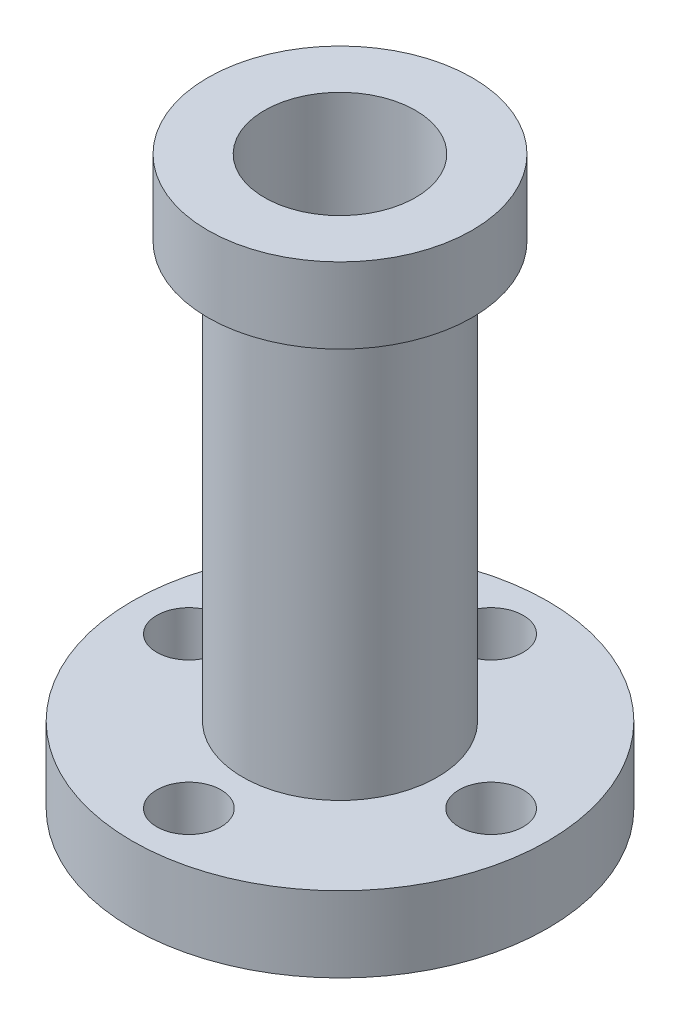
ISO-10303-21;
HEADER;
FILE_DESCRIPTION(('STEP AP214'),'2;1');
FILE_NAME('part.step','',(''),(''),'','','');
FILE_SCHEMA(('AUTOMOTIVE_DESIGN { 1 0 10303 214 1 1 1 1 }'));
ENDSEC;
DATA;
#1=APPLICATION_CONTEXT('core data for automotive mechanical design processes');
#2=APPLICATION_PROTOCOL_DEFINITION('international standard','automotive_design',2000,#1);
#3=PRODUCT_CONTEXT('',#1,'mechanical');
#4=PRODUCT('Part','Part','',(#3));
#5=PRODUCT_RELATED_PRODUCT_CATEGORY('part','',(#4));
#6=PRODUCT_DEFINITION_FORMATION('','',#4);
#7=PRODUCT_DEFINITION_CONTEXT('part definition',#1,'design');
#8=PRODUCT_DEFINITION('design','',#6,#7);
#9=PRODUCT_DEFINITION_SHAPE('','',#8);
#10=(LENGTH_UNIT() NAMED_UNIT(*) SI_UNIT(.MILLI.,.METRE.));
#11=(NAMED_UNIT(*) PLANE_ANGLE_UNIT() SI_UNIT($,.RADIAN.));
#12=(NAMED_UNIT(*) SI_UNIT($,.STERADIAN.) SOLID_ANGLE_UNIT());
#13=UNCERTAINTY_MEASURE_WITH_UNIT(LENGTH_MEASURE(1.E-05),#10,'distance_accuracy_value','');
#14=(GEOMETRIC_REPRESENTATION_CONTEXT(3) GLOBAL_UNCERTAINTY_ASSIGNED_CONTEXT((#13)) GLOBAL_UNIT_ASSIGNED_CONTEXT((#10,
#11,#12)) REPRESENTATION_CONTEXT('',''));
#15=CARTESIAN_POINT('',(0.,0.,0.));
#16=DIRECTION('',(0.,0.,1.));
#17=DIRECTION('',(1.,0.,0.));
#18=AXIS2_PLACEMENT_3D('',#15,#16,#17);
#19=CARTESIAN_POINT('',(11.,4.,0.));
#20=DIRECTION('',(0.,1.,0.));
#21=DIRECTION('',(0.,0.,1.));
#22=AXIS2_PLACEMENT_3D('',#19,#20,#21);
#23=PLANE('',#22);
#24=CARTESIAN_POINT('',(8.,4.,0.));
#25=DIRECTION('',(0.,1.,0.));
#26=DIRECTION('',(0.,0.,1.));
#27=AXIS2_PLACEMENT_3D('',#24,#25,#26);
#28=CIRCLE('',#27,1.69999999999999);
#29=CARTESIAN_POINT('',(8.,4.,1.69999999999999));
#30=VERTEX_POINT('',#29);
#31=EDGE_CURVE('E93',#30,#30,#28,.F.);
#32=ORIENTED_EDGE('',*,*,#31,.T.);
#33=EDGE_LOOP('',(#32));
#34=FACE_BOUND('',#33,.T.);
#35=CARTESIAN_POINT('',(-8.,4.,0.));
#36=DIRECTION('',(0.,1.,0.));
#37=DIRECTION('',(0.,0.,1.));
#38=AXIS2_PLACEMENT_3D('',#35,#36,#37);
#39=CIRCLE('',#38,1.69999999999999);
#40=CARTESIAN_POINT('',(-8.,4.,1.69999999999999));
#41=VERTEX_POINT('',#40);
#42=EDGE_CURVE('E77',#41,#41,#39,.F.);
#43=ORIENTED_EDGE('',*,*,#42,.T.);
#44=EDGE_LOOP('',(#43));
#45=FACE_BOUND('',#44,.T.);
#46=CARTESIAN_POINT('',(0.,4.,0.));
#47=DIRECTION('',(0.,-1.,0.));
#48=DIRECTION('',(0.,0.,-1.));
#49=AXIS2_PLACEMENT_3D('',#46,#47,#48);
#50=CIRCLE('',#49,5.15);
#51=CARTESIAN_POINT('',(0.,4.,-5.15));
#52=VERTEX_POINT('',#51);
#53=EDGE_CURVE('E61',#52,#52,#50,.T.);
#54=ORIENTED_EDGE('',*,*,#53,.T.);
#55=EDGE_LOOP('',(#54));
#56=FACE_BOUND('',#55,.T.);
#57=CARTESIAN_POINT('',(0.,4.,0.));
#58=DIRECTION('',(0.,-1.,0.));
#59=DIRECTION('',(0.,0.,-1.));
#60=AXIS2_PLACEMENT_3D('',#57,#58,#59);
#61=CIRCLE('',#60,11.);
#62=CARTESIAN_POINT('',(0.,4.,-11.));
#63=VERTEX_POINT('',#62);
#64=EDGE_CURVE('E55',#63,#63,#61,.T.);
#65=ORIENTED_EDGE('',*,*,#64,.F.);
#66=EDGE_LOOP('',(#65));
#67=FACE_BOUND('',#66,.T.);
#68=CARTESIAN_POINT('',(0.,4.,-8.));
#69=DIRECTION('',(0.,1.,0.));
#70=DIRECTION('',(0.,0.,1.));
#71=AXIS2_PLACEMENT_3D('',#68,#69,#70);
#72=CIRCLE('',#71,1.69999999999999);
#73=CARTESIAN_POINT('',(0.,4.,-6.30000000000001));
#74=VERTEX_POINT('',#73);
#75=EDGE_CURVE('E85',#74,#74,#72,.F.);
#76=ORIENTED_EDGE('',*,*,#75,.T.);
#77=EDGE_LOOP('',(#76));
#78=FACE_BOUND('',#77,.T.);
#79=CARTESIAN_POINT('',(0.,4.,8.));
#80=DIRECTION('',(0.,1.,0.));
#81=DIRECTION('',(0.,0.,1.));
#82=AXIS2_PLACEMENT_3D('',#79,#80,#81);
#83=CIRCLE('',#82,1.69999999999999);
#84=CARTESIAN_POINT('',(0.,4.,9.69999999999999));
#85=VERTEX_POINT('',#84);
#86=EDGE_CURVE('E101',#85,#85,#83,.F.);
#87=ORIENTED_EDGE('',*,*,#86,.T.);
#88=EDGE_LOOP('',(#87));
#89=FACE_BOUND('',#88,.T.);
#90=ADVANCED_FACE('F37',(#34,#45,#56,#67,#78,#89),#23,.T.);
#91=CARTESIAN_POINT('',(7.,30.,0.));
#92=DIRECTION('',(0.,1.,0.));
#93=DIRECTION('',(0.,0.,1.));
#94=AXIS2_PLACEMENT_3D('',#91,#92,#93);
#95=PLANE('',#94);
#96=CARTESIAN_POINT('',(0.,30.,0.));
#97=DIRECTION('',(0.,-1.,0.));
#98=DIRECTION('',(0.,0.,-1.));
#99=AXIS2_PLACEMENT_3D('',#96,#97,#98);
#100=CIRCLE('',#99,4.);
#101=CARTESIAN_POINT('',(0.,30.,-4.));
#102=VERTEX_POINT('',#101);
#103=EDGE_CURVE('E10',#102,#102,#100,.T.);
#104=ORIENTED_EDGE('',*,*,#103,.T.);
#105=EDGE_LOOP('',(#104));
#106=FACE_BOUND('',#105,.T.);
#107=CARTESIAN_POINT('',(0.,30.,0.));
#108=DIRECTION('',(0.,-1.,0.));
#109=DIRECTION('',(0.,0.,-1.));
#110=AXIS2_PLACEMENT_3D('',#107,#108,#109);
#111=CIRCLE('',#110,7.);
#112=CARTESIAN_POINT('',(0.,30.,-7.));
#113=VERTEX_POINT('',#112);
#114=EDGE_CURVE('E73',#113,#113,#111,.T.);
#115=ORIENTED_EDGE('',*,*,#114,.F.);
#116=EDGE_LOOP('',(#115));
#117=FACE_BOUND('',#116,.T.);
#118=ADVANCED_FACE('F39',(#106,#117),#95,.T.);
#119=CARTESIAN_POINT('',(0.,0.,0.));
#120=DIRECTION('',(0.,-1.,0.));
#121=DIRECTION('',(0.,0.,-1.));
#122=AXIS2_PLACEMENT_3D('',#119,#120,#121);
#123=CYLINDRICAL_SURFACE('',#122,4.);
#124=CARTESIAN_POINT('',(0.,0.,0.));
#125=DIRECTION('',(0.,-1.,0.));
#126=DIRECTION('',(0.,0.,-1.));
#127=AXIS2_PLACEMENT_3D('',#124,#125,#126);
#128=CIRCLE('',#127,4.);
#129=CARTESIAN_POINT('',(0.,0.,-4.));
#130=VERTEX_POINT('',#129);
#131=EDGE_CURVE('E45',#130,#130,#128,.T.);
#132=ORIENTED_EDGE('',*,*,#131,.T.);
#133=EDGE_LOOP('',(#132));
#134=FACE_BOUND('',#133,.T.);
#135=ORIENTED_EDGE('',*,*,#103,.F.);
#136=EDGE_LOOP('',(#135));
#137=FACE_BOUND('',#136,.T.);
#138=ADVANCED_FACE('F116',(#134,#137),#123,.F.);
#139=CARTESIAN_POINT('',(4.,0.,0.));
#140=DIRECTION('',(0.,-1.,0.));
#141=DIRECTION('',(0.,0.,-1.));
#142=AXIS2_PLACEMENT_3D('',#139,#140,#141);
#143=PLANE('',#142);
#144=CARTESIAN_POINT('',(0.,0.,8.));
#145=DIRECTION('',(0.,-1.,0.));
#146=DIRECTION('',(0.,0.,-1.));
#147=AXIS2_PLACEMENT_3D('',#144,#145,#146);
#148=CIRCLE('',#147,1.69999999999999);
#149=CARTESIAN_POINT('',(0.,0.,6.30000000000001));
#150=VERTEX_POINT('',#149);
#151=EDGE_CURVE('E105',#150,#150,#148,.T.);
#152=ORIENTED_EDGE('',*,*,#151,.F.);
#153=EDGE_LOOP('',(#152));
#154=FACE_BOUND('',#153,.T.);
#155=CARTESIAN_POINT('',(8.,0.,0.));
#156=DIRECTION('',(0.,-1.,0.));
#157=DIRECTION('',(0.,0.,-1.));
#158=AXIS2_PLACEMENT_3D('',#155,#156,#157);
#159=CIRCLE('',#158,1.69999999999999);
#160=CARTESIAN_POINT('',(8.,0.,-1.69999999999999));
#161=VERTEX_POINT('',#160);
#162=EDGE_CURVE('E97',#161,#161,#159,.T.);
#163=ORIENTED_EDGE('',*,*,#162,.F.);
#164=EDGE_LOOP('',(#163));
#165=FACE_BOUND('',#164,.T.);
#166=CARTESIAN_POINT('',(0.,0.,-8.));
#167=DIRECTION('',(0.,-1.,0.));
#168=DIRECTION('',(0.,0.,-1.));
#169=AXIS2_PLACEMENT_3D('',#166,#167,#168);
#170=CIRCLE('',#169,1.69999999999999);
#171=CARTESIAN_POINT('',(0.,0.,-9.69999999999999));
#172=VERTEX_POINT('',#171);
#173=EDGE_CURVE('E89',#172,#172,#170,.T.);
#174=ORIENTED_EDGE('',*,*,#173,.F.);
#175=EDGE_LOOP('',(#174));
#176=FACE_BOUND('',#175,.T.);
#177=CARTESIAN_POINT('',(-8.,0.,0.));
#178=DIRECTION('',(0.,-1.,0.));
#179=DIRECTION('',(0.,0.,-1.));
#180=AXIS2_PLACEMENT_3D('',#177,#178,#179);
#181=CIRCLE('',#180,1.69999999999999);
#182=CARTESIAN_POINT('',(-8.,0.,-1.69999999999999));
#183=VERTEX_POINT('',#182);
#184=EDGE_CURVE('E81',#183,#183,#181,.T.);
#185=ORIENTED_EDGE('',*,*,#184,.F.);
#186=EDGE_LOOP('',(#185));
#187=FACE_BOUND('',#186,.T.);
#188=CARTESIAN_POINT('',(0.,0.,0.));
#189=DIRECTION('',(0.,-1.,0.));
#190=DIRECTION('',(0.,0.,-1.));
#191=AXIS2_PLACEMENT_3D('',#188,#189,#190);
#192=CIRCLE('',#191,11.);
#193=CARTESIAN_POINT('',(0.,0.,-11.));
#194=VERTEX_POINT('',#193);
#195=EDGE_CURVE('E50',#194,#194,#192,.T.);
#196=ORIENTED_EDGE('',*,*,#195,.T.);
#197=EDGE_LOOP('',(#196));
#198=FACE_BOUND('',#197,.T.);
#199=ORIENTED_EDGE('',*,*,#131,.F.);
#200=EDGE_LOOP('',(#199));
#201=FACE_BOUND('',#200,.T.);
#202=ADVANCED_FACE('F112',(#154,#165,#176,#187,#198,#201),#143,.T.);
#203=CARTESIAN_POINT('',(0.,0.,0.));
#204=DIRECTION('',(0.,-1.,0.));
#205=DIRECTION('',(0.,0.,-1.));
#206=AXIS2_PLACEMENT_3D('',#203,#204,#205);
#207=CYLINDRICAL_SURFACE('',#206,11.);
#208=ORIENTED_EDGE('',*,*,#64,.T.);
#209=EDGE_LOOP('',(#208));
#210=FACE_BOUND('',#209,.T.);
#211=ORIENTED_EDGE('',*,*,#195,.F.);
#212=EDGE_LOOP('',(#211));
#213=FACE_BOUND('',#212,.T.);
#214=ADVANCED_FACE('F115',(#210,#213),#207,.T.);
#215=CARTESIAN_POINT('',(0.,0.,0.));
#216=DIRECTION('',(0.,-1.,0.));
#217=DIRECTION('',(0.,0.,-1.));
#218=AXIS2_PLACEMENT_3D('',#215,#216,#217);
#219=CYLINDRICAL_SURFACE('',#218,5.15);
#220=CARTESIAN_POINT('',(0.,26.,0.));
#221=DIRECTION('',(0.,-1.,0.));
#222=DIRECTION('',(0.,0.,-1.));
#223=AXIS2_PLACEMENT_3D('',#220,#221,#222);
#224=CIRCLE('',#223,5.15);
#225=CARTESIAN_POINT('',(0.,26.,-5.15));
#226=VERTEX_POINT('',#225);
#227=EDGE_CURVE('E65',#226,#226,#224,.T.);
#228=ORIENTED_EDGE('',*,*,#227,.T.);
#229=EDGE_LOOP('',(#228));
#230=FACE_BOUND('',#229,.T.);
#231=ORIENTED_EDGE('',*,*,#53,.F.);
#232=EDGE_LOOP('',(#231));
#233=FACE_BOUND('',#232,.T.);
#234=ADVANCED_FACE('F128',(#230,#233),#219,.T.);
#235=CARTESIAN_POINT('',(5.15,26.,0.));
#236=DIRECTION('',(0.,-1.,0.));
#237=DIRECTION('',(0.,0.,-1.));
#238=AXIS2_PLACEMENT_3D('',#235,#236,#237);
#239=PLANE('',#238);
#240=CARTESIAN_POINT('',(0.,26.,0.));
#241=DIRECTION('',(0.,-1.,0.));
#242=DIRECTION('',(0.,0.,-1.));
#243=AXIS2_PLACEMENT_3D('',#240,#241,#242);
#244=CIRCLE('',#243,7.);
#245=CARTESIAN_POINT('',(0.,26.,-7.));
#246=VERTEX_POINT('',#245);
#247=EDGE_CURVE('E69',#246,#246,#244,.T.);
#248=ORIENTED_EDGE('',*,*,#247,.T.);
#249=EDGE_LOOP('',(#248));
#250=FACE_BOUND('',#249,.T.);
#251=ORIENTED_EDGE('',*,*,#227,.F.);
#252=EDGE_LOOP('',(#251));
#253=FACE_BOUND('',#252,.T.);
#254=ADVANCED_FACE('F134',(#250,#253),#239,.T.);
#255=CARTESIAN_POINT('',(0.,0.,0.));
#256=DIRECTION('',(0.,-1.,0.));
#257=DIRECTION('',(0.,0.,-1.));
#258=AXIS2_PLACEMENT_3D('',#255,#256,#257);
#259=CYLINDRICAL_SURFACE('',#258,7.);
#260=ORIENTED_EDGE('',*,*,#114,.T.);
#261=EDGE_LOOP('',(#260));
#262=FACE_BOUND('',#261,.T.);
#263=ORIENTED_EDGE('',*,*,#247,.F.);
#264=EDGE_LOOP('',(#263));
#265=FACE_BOUND('',#264,.T.);
#266=ADVANCED_FACE('F147',(#262,#265),#259,.T.);
#267=CARTESIAN_POINT('',(-8.,0.,0.));
#268=DIRECTION('',(0.,-1.,0.));
#269=DIRECTION('',(0.,0.,-1.));
#270=AXIS2_PLACEMENT_3D('',#267,#268,#269);
#271=CYLINDRICAL_SURFACE('',#270,1.69999999999999);
#272=ORIENTED_EDGE('',*,*,#42,.F.);
#273=EDGE_LOOP('',(#272));
#274=FACE_BOUND('',#273,.T.);
#275=ORIENTED_EDGE('',*,*,#184,.T.);
#276=EDGE_LOOP('',(#275));
#277=FACE_BOUND('',#276,.T.);
#278=ADVANCED_FACE('F151',(#274,#277),#271,.F.);
#279=CARTESIAN_POINT('',(0.,0.,-8.));
#280=DIRECTION('',(0.,-1.,0.));
#281=DIRECTION('',(0.,0.,-1.));
#282=AXIS2_PLACEMENT_3D('',#279,#280,#281);
#283=CYLINDRICAL_SURFACE('',#282,1.69999999999999);
#284=ORIENTED_EDGE('',*,*,#75,.F.);
#285=EDGE_LOOP('',(#284));
#286=FACE_BOUND('',#285,.T.);
#287=ORIENTED_EDGE('',*,*,#173,.T.);
#288=EDGE_LOOP('',(#287));
#289=FACE_BOUND('',#288,.T.);
#290=ADVANCED_FACE('F155',(#286,#289),#283,.F.);
#291=CARTESIAN_POINT('',(8.,0.,0.));
#292=DIRECTION('',(0.,-1.,0.));
#293=DIRECTION('',(0.,0.,-1.));
#294=AXIS2_PLACEMENT_3D('',#291,#292,#293);
#295=CYLINDRICAL_SURFACE('',#294,1.69999999999999);
#296=ORIENTED_EDGE('',*,*,#31,.F.);
#297=EDGE_LOOP('',(#296));
#298=FACE_BOUND('',#297,.T.);
#299=ORIENTED_EDGE('',*,*,#162,.T.);
#300=EDGE_LOOP('',(#299));
#301=FACE_BOUND('',#300,.T.);
#302=ADVANCED_FACE('F159',(#298,#301),#295,.F.);
#303=CARTESIAN_POINT('',(0.,0.,8.));
#304=DIRECTION('',(0.,-1.,0.));
#305=DIRECTION('',(0.,0.,-1.));
#306=AXIS2_PLACEMENT_3D('',#303,#304,#305);
#307=CYLINDRICAL_SURFACE('',#306,1.69999999999999);
#308=ORIENTED_EDGE('',*,*,#86,.F.);
#309=EDGE_LOOP('',(#308));
#310=FACE_BOUND('',#309,.T.);
#311=ORIENTED_EDGE('',*,*,#151,.T.);
#312=EDGE_LOOP('',(#311));
#313=FACE_BOUND('',#312,.T.);
#314=ADVANCED_FACE('F110',(#310,#313),#307,.F.);
#315=CLOSED_SHELL('',(#90,#118,#138,#202,#214,#234,#254,#266,#278,#290,#302,#314));
#316=MANIFOLD_SOLID_BREP('B2',#315);
#317=ADVANCED_BREP_SHAPE_REPRESENTATION('',(#18,#316),#14);
#318=SHAPE_DEFINITION_REPRESENTATION(#9,#317);
ENDSEC;
END-ISO-10303-21;
